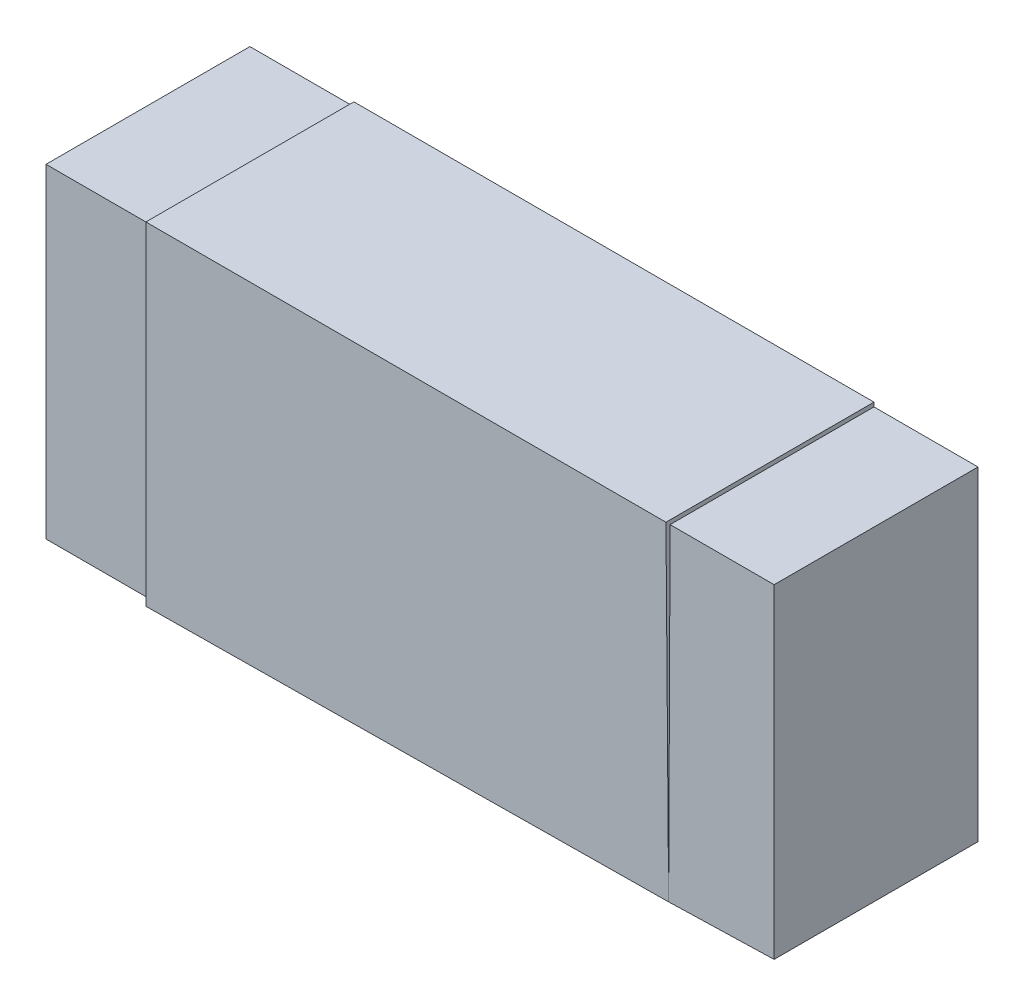
ISO-10303-21;
HEADER;
FILE_DESCRIPTION(('STEP AP214'),'2;1');
FILE_NAME('part.step','',(''),(''),'','','');
FILE_SCHEMA(('AUTOMOTIVE_DESIGN { 1 0 10303 214 1 1 1 1 }'));
ENDSEC;
DATA;
#1=APPLICATION_CONTEXT('core data for automotive mechanical design processes');
#2=APPLICATION_PROTOCOL_DEFINITION('international standard','automotive_design',2000,#1);
#3=PRODUCT_CONTEXT('',#1,'mechanical');
#4=PRODUCT('Part','Part','',(#3));
#5=PRODUCT_RELATED_PRODUCT_CATEGORY('part','',(#4));
#6=PRODUCT_DEFINITION_FORMATION('','',#4);
#7=PRODUCT_DEFINITION_CONTEXT('part definition',#1,'design');
#8=PRODUCT_DEFINITION('design','',#6,#7);
#9=PRODUCT_DEFINITION_SHAPE('','',#8);
#10=(LENGTH_UNIT() NAMED_UNIT(*) SI_UNIT(.MILLI.,.METRE.));
#11=(NAMED_UNIT(*) PLANE_ANGLE_UNIT() SI_UNIT($,.RADIAN.));
#12=(NAMED_UNIT(*) SI_UNIT($,.STERADIAN.) SOLID_ANGLE_UNIT());
#13=UNCERTAINTY_MEASURE_WITH_UNIT(LENGTH_MEASURE(1.E-05),#10,'distance_accuracy_value','');
#14=(GEOMETRIC_REPRESENTATION_CONTEXT(3) GLOBAL_UNCERTAINTY_ASSIGNED_CONTEXT((#13)) GLOBAL_UNIT_ASSIGNED_CONTEXT((#10,
#11,#12)) REPRESENTATION_CONTEXT('',''));
#15=CARTESIAN_POINT('',(0.,0.,0.));
#16=DIRECTION('',(0.,0.,1.));
#17=DIRECTION('',(1.,0.,0.));
#18=AXIS2_PLACEMENT_3D('',#15,#16,#17);
#19=CARTESIAN_POINT('',(-0.625,0.4,0.5));
#20=DIRECTION('',(1.,0.,0.));
#21=DIRECTION('',(0.,1.,0.));
#22=AXIS2_PLACEMENT_3D('',#19,#20,#21);
#23=PLANE('',#22);
#24=DIRECTION('',(0.,0.,-1.));
#25=VECTOR('',#24,1.);
#26=CARTESIAN_POINT('',(-0.625,0.39,0.49));
#27=LINE('',#26,#25);
#28=CARTESIAN_POINT('',(-0.625,0.39,0.49));
#29=VERTEX_POINT('',#28);
#30=CARTESIAN_POINT('',(-0.625,0.39,0.));
#31=VERTEX_POINT('',#30);
#32=EDGE_CURVE('E138',#29,#31,#27,.T.);
#33=ORIENTED_EDGE('',*,*,#32,.F.);
#34=DIRECTION('',(0.,-1.,0.));
#35=VECTOR('',#34,1.);
#36=CARTESIAN_POINT('',(-0.625,0.39,0.49));
#37=LINE('',#36,#35);
#38=CARTESIAN_POINT('',(-0.625,-0.39,0.49));
#39=VERTEX_POINT('',#38);
#40=EDGE_CURVE('E131',#29,#39,#37,.T.);
#41=ORIENTED_EDGE('',*,*,#40,.T.);
#42=DIRECTION('',(0.,0.,-1.));
#43=VECTOR('',#42,1.);
#44=CARTESIAN_POINT('',(-0.625,-0.39,0.49));
#45=LINE('',#44,#43);
#46=CARTESIAN_POINT('',(-0.625,-0.39,0.));
#47=VERTEX_POINT('',#46);
#48=EDGE_CURVE('E117',#39,#47,#45,.T.);
#49=ORIENTED_EDGE('',*,*,#48,.T.);
#50=DIRECTION('',(0.,-1.,0.));
#51=VECTOR('',#50,1.);
#52=CARTESIAN_POINT('',(-0.625,0.4,0.));
#53=LINE('',#52,#51);
#54=CARTESIAN_POINT('',(-0.625,-0.4,0.));
#55=VERTEX_POINT('',#54);
#56=EDGE_CURVE('E248',#47,#55,#53,.T.);
#57=ORIENTED_EDGE('',*,*,#56,.T.);
#58=DIRECTION('',(0.,0.,-1.));
#59=VECTOR('',#58,1.);
#60=CARTESIAN_POINT('',(-0.625,-0.4,0.5));
#61=LINE('',#60,#59);
#62=CARTESIAN_POINT('',(-0.625,-0.4,0.5));
#63=VERTEX_POINT('',#62);
#64=EDGE_CURVE('E256',#63,#55,#61,.T.);
#65=ORIENTED_EDGE('',*,*,#64,.F.);
#66=DIRECTION('',(0.,-1.,0.));
#67=VECTOR('',#66,1.);
#68=CARTESIAN_POINT('',(-0.625,0.4,0.5));
#69=LINE('',#68,#67);
#70=CARTESIAN_POINT('',(-0.625,0.4,0.5));
#71=VERTEX_POINT('',#70);
#72=EDGE_CURVE('E231',#71,#63,#69,.T.);
#73=ORIENTED_EDGE('',*,*,#72,.F.);
#74=DIRECTION('',(0.,0.,-1.));
#75=VECTOR('',#74,1.);
#76=CARTESIAN_POINT('',(-0.625,0.4,0.5));
#77=LINE('',#76,#75);
#78=CARTESIAN_POINT('',(-0.625,0.4,0.));
#79=VERTEX_POINT('',#78);
#80=EDGE_CURVE('E43',#71,#79,#77,.T.);
#81=ORIENTED_EDGE('',*,*,#80,.T.);
#82=EDGE_CURVE('E243',#79,#31,#53,.T.);
#83=ORIENTED_EDGE('',*,*,#82,.T.);
#84=EDGE_LOOP('',(#33,#41,#49,#57,#65,#73,#81,#83));
#85=FACE_BOUND('',#84,.T.);
#86=ADVANCED_FACE('F34',(#85),#23,.F.);
#87=CARTESIAN_POINT('',(0.625,0.4,0.5));
#88=DIRECTION('',(-1.,0.,0.));
#89=DIRECTION('',(0.,-1.,0.));
#90=AXIS2_PLACEMENT_3D('',#87,#88,#89);
#91=PLANE('',#90);
#92=DIRECTION('',(0.,1.,0.));
#93=VECTOR('',#92,1.);
#94=CARTESIAN_POINT('',(0.625,0.4,0.5));
#95=LINE('',#94,#93);
#96=CARTESIAN_POINT('',(0.625,-0.393535533905933,0.493535533905933));
#97=VERTEX_POINT('',#96);
#98=CARTESIAN_POINT('',(0.625,0.4,0.5));
#99=VERTEX_POINT('',#98);
#100=EDGE_CURVE('E234',#97,#99,#95,.T.);
#101=ORIENTED_EDGE('',*,*,#100,.F.);
#102=DIRECTION('',(0.,1.,0.));
#103=VECTOR('',#102,1.);
#104=CARTESIAN_POINT('',(0.625,0.39,0.49));
#105=LINE('',#104,#103);
#106=CARTESIAN_POINT('',(0.625,0.39,0.49));
#107=VERTEX_POINT('',#106);
#108=EDGE_CURVE('E158',#97,#107,#105,.T.);
#109=ORIENTED_EDGE('',*,*,#108,.T.);
#110=DIRECTION('',(0.,0.,-1.));
#111=VECTOR('',#110,1.);
#112=CARTESIAN_POINT('',(0.625,0.39,0.49));
#113=LINE('',#112,#111);
#114=CARTESIAN_POINT('',(0.625,0.39,0.));
#115=VERTEX_POINT('',#114);
#116=EDGE_CURVE('E171',#107,#115,#113,.T.);
#117=ORIENTED_EDGE('',*,*,#116,.T.);
#118=DIRECTION('',(0.,1.,0.));
#119=VECTOR('',#118,1.);
#120=CARTESIAN_POINT('',(0.625,0.4,0.));
#121=LINE('',#120,#119);
#122=CARTESIAN_POINT('',(0.625,0.4,0.));
#123=VERTEX_POINT('',#122);
#124=EDGE_CURVE('E38',#115,#123,#121,.T.);
#125=ORIENTED_EDGE('',*,*,#124,.T.);
#126=DIRECTION('',(0.,0.,-1.));
#127=VECTOR('',#126,1.);
#128=CARTESIAN_POINT('',(0.625,0.4,0.5));
#129=LINE('',#128,#127);
#130=EDGE_CURVE('E11',#99,#123,#129,.T.);
#131=ORIENTED_EDGE('',*,*,#130,.F.);
#132=EDGE_LOOP('',(#101,#109,#117,#125,#131));
#133=FACE_BOUND('',#132,.T.);
#134=ADVANCED_FACE('F36',(#133),#91,.F.);
#135=CARTESIAN_POINT('',(-0.625,0.4,0.5));
#136=DIRECTION('',(0.,-1.,0.));
#137=DIRECTION('',(0.,0.,-1.));
#138=AXIS2_PLACEMENT_3D('',#135,#136,#137);
#139=PLANE('',#138);
#140=DIRECTION('',(-1.,0.,0.));
#141=VECTOR('',#140,1.);
#142=CARTESIAN_POINT('',(-0.625,0.4,0.));
#143=LINE('',#142,#141);
#144=EDGE_CURVE('E252',#123,#79,#143,.T.);
#145=ORIENTED_EDGE('',*,*,#144,.T.);
#146=ORIENTED_EDGE('',*,*,#80,.F.);
#147=DIRECTION('',(-1.,0.,0.));
#148=VECTOR('',#147,1.);
#149=CARTESIAN_POINT('',(-0.625,0.4,0.5));
#150=LINE('',#149,#148);
#151=EDGE_CURVE('E237',#99,#71,#150,.T.);
#152=ORIENTED_EDGE('',*,*,#151,.F.);
#153=ORIENTED_EDGE('',*,*,#130,.T.);
#154=EDGE_LOOP('',(#145,#146,#152,#153));
#155=FACE_BOUND('',#154,.T.);
#156=ADVANCED_FACE('F216',(#155),#139,.F.);
#157=CARTESIAN_POINT('',(-0.625,-0.4,0.5));
#158=DIRECTION('',(0.,1.,0.));
#159=DIRECTION('',(0.,0.,1.));
#160=AXIS2_PLACEMENT_3D('',#157,#158,#159);
#161=PLANE('',#160);
#162=DIRECTION('',(1.,0.,0.));
#163=VECTOR('',#162,1.);
#164=CARTESIAN_POINT('',(-0.625,-0.4,0.));
#165=LINE('',#164,#163);
#166=CARTESIAN_POINT('',(0.625,-0.395,0.));
#167=VERTEX_POINT('',#166);
#168=EDGE_CURVE('E238',#55,#167,#165,.T.);
#169=ORIENTED_EDGE('',*,*,#168,.T.);
#170=CARTESIAN_POINT('',(0.625,-0.39,0.49));
#171=DIRECTION('',(0.,0.,-1.));
#172=VECTOR('',#171,1.);
#173=LINE('',#170,#172);
#174=EDGE_CURVE('E178',#97,#167,#173,.T.);
#175=ORIENTED_EDGE('',*,*,#174,.F.);
#176=DIRECTION('',(1.,0.,0.));
#177=VECTOR('',#176,1.);
#178=CARTESIAN_POINT('',(-0.625,-0.4,0.5));
#179=LINE('',#178,#177);
#180=EDGE_CURVE('E223',#63,#97,#179,.T.);
#181=ORIENTED_EDGE('',*,*,#180,.F.);
#182=ORIENTED_EDGE('',*,*,#64,.T.);
#183=EDGE_LOOP('',(#169,#175,#181,#182));
#184=FACE_BOUND('',#183,.T.);
#185=ADVANCED_FACE('F208',(#184),#161,.F.);
#186=CARTESIAN_POINT('',(0.,0.,0.5));
#187=DIRECTION('',(0.,0.,1.));
#188=DIRECTION('',(1.,0.,0.));
#189=AXIS2_PLACEMENT_3D('',#186,#187,#188);
#190=PLANE('',#189);
#191=ORIENTED_EDGE('',*,*,#100,.T.);
#192=ORIENTED_EDGE('',*,*,#151,.T.);
#193=ORIENTED_EDGE('',*,*,#72,.T.);
#194=ORIENTED_EDGE('',*,*,#180,.T.);
#195=EDGE_LOOP('',(#191,#192,#193,#194));
#196=FACE_BOUND('',#195,.T.);
#197=ADVANCED_FACE('F205',(#196),#190,.T.);
#198=CARTESIAN_POINT('',(0.,0.,0.));
#199=DIRECTION('',(0.,0.,1.));
#200=DIRECTION('',(1.,0.,0.));
#201=AXIS2_PLACEMENT_3D('',#198,#199,#200);
#202=PLANE('',#201);
#203=ORIENTED_EDGE('',*,*,#124,.F.);
#204=DIRECTION('',(1.,0.,0.));
#205=VECTOR('',#204,1.);
#206=CARTESIAN_POINT('',(0.625,0.39,0.));
#207=LINE('',#206,#205);
#208=CARTESIAN_POINT('',(0.875,0.39,0.));
#209=VERTEX_POINT('',#208);
#210=EDGE_CURVE('E59',#115,#209,#207,.T.);
#211=ORIENTED_EDGE('',*,*,#210,.T.);
#212=DIRECTION('',(0.,-1.,0.));
#213=VECTOR('',#212,1.);
#214=CARTESIAN_POINT('',(0.875,0.39,0.));
#215=LINE('',#214,#213);
#216=CARTESIAN_POINT('',(0.875,-0.39,0.));
#217=VERTEX_POINT('',#216);
#218=EDGE_CURVE('E163',#209,#217,#215,.T.);
#219=ORIENTED_EDGE('',*,*,#218,.T.);
#220=DIRECTION('',(-1.,0.,0.));
#221=VECTOR('',#220,1.);
#222=CARTESIAN_POINT('',(0.625,-0.39,0.));
#223=LINE('',#222,#221);
#224=EDGE_CURVE('E166',#217,#167,#223,.T.);
#225=ORIENTED_EDGE('',*,*,#224,.T.);
#226=ORIENTED_EDGE('',*,*,#168,.F.);
#227=ORIENTED_EDGE('',*,*,#56,.F.);
#228=DIRECTION('',(-1.,0.,0.));
#229=VECTOR('',#228,1.);
#230=CARTESIAN_POINT('',(-0.625,-0.39,0.));
#231=LINE('',#230,#229);
#232=CARTESIAN_POINT('',(-0.875,-0.39,0.));
#233=VERTEX_POINT('',#232);
#234=EDGE_CURVE('E51',#47,#233,#231,.T.);
#235=ORIENTED_EDGE('',*,*,#234,.T.);
#236=DIRECTION('',(0.,1.,0.));
#237=VECTOR('',#236,1.);
#238=CARTESIAN_POINT('',(-0.875,0.39,0.));
#239=LINE('',#238,#237);
#240=CARTESIAN_POINT('',(-0.875,0.39,0.));
#241=VERTEX_POINT('',#240);
#242=EDGE_CURVE('E142',#233,#241,#239,.T.);
#243=ORIENTED_EDGE('',*,*,#242,.T.);
#244=DIRECTION('',(1.,0.,0.));
#245=VECTOR('',#244,1.);
#246=CARTESIAN_POINT('',(-0.625,0.39,0.));
#247=LINE('',#246,#245);
#248=EDGE_CURVE('E139',#241,#31,#247,.T.);
#249=ORIENTED_EDGE('',*,*,#248,.T.);
#250=ORIENTED_EDGE('',*,*,#82,.F.);
#251=ORIENTED_EDGE('',*,*,#144,.F.);
#252=EDGE_LOOP('',(#203,#211,#219,#225,#226,#227,#235,#243,#249,#250,#251));
#253=FACE_BOUND('',#252,.T.);
#254=ADVANCED_FACE('F196',(#253),#202,.F.);
#255=CARTESIAN_POINT('',(0.625,-0.39,0.49));
#256=DIRECTION('',(0.,-1.,0.));
#257=DIRECTION('',(1.,0.,0.));
#258=AXIS2_PLACEMENT_3D('',#255,#256,#257);
#259=PLANE('',#258);
#260=ORIENTED_EDGE('',*,*,#224,.F.);
#261=DIRECTION('',(0.,0.,-1.));
#262=VECTOR('',#261,1.);
#263=CARTESIAN_POINT('',(0.875,-0.39,0.49));
#264=LINE('',#263,#262);
#265=CARTESIAN_POINT('',(0.875,-0.39,0.49));
#266=VERTEX_POINT('',#265);
#267=EDGE_CURVE('E167',#266,#217,#264,.T.);
#268=ORIENTED_EDGE('',*,*,#267,.F.);
#269=DIRECTION('',(-1.,0.,0.));
#270=VECTOR('',#269,1.);
#271=CARTESIAN_POINT('',(0.625,-0.39,0.49));
#272=LINE('',#271,#270);
#273=EDGE_CURVE('E161',#266,#97,#272,.T.);
#274=ORIENTED_EDGE('',*,*,#273,.T.);
#275=ORIENTED_EDGE('',*,*,#174,.T.);
#276=EDGE_LOOP('',(#260,#268,#274,#275));
#277=FACE_BOUND('',#276,.T.);
#278=ADVANCED_FACE('F185',(#277),#259,.T.);
#279=CARTESIAN_POINT('',(0.875,0.39,0.49));
#280=DIRECTION('',(1.,0.,0.));
#281=DIRECTION('',(0.,1.,0.));
#282=AXIS2_PLACEMENT_3D('',#279,#280,#281);
#283=PLANE('',#282);
#284=ORIENTED_EDGE('',*,*,#218,.F.);
#285=DIRECTION('',(0.,0.,-1.));
#286=VECTOR('',#285,1.);
#287=CARTESIAN_POINT('',(0.875,0.39,0.49));
#288=LINE('',#287,#286);
#289=CARTESIAN_POINT('',(0.875,0.39,0.49));
#290=VERTEX_POINT('',#289);
#291=EDGE_CURVE('E169',#290,#209,#288,.T.);
#292=ORIENTED_EDGE('',*,*,#291,.F.);
#293=DIRECTION('',(0.,-1.,0.));
#294=VECTOR('',#293,1.);
#295=CARTESIAN_POINT('',(0.875,0.39,0.49));
#296=LINE('',#295,#294);
#297=EDGE_CURVE('E157',#290,#266,#296,.T.);
#298=ORIENTED_EDGE('',*,*,#297,.T.);
#299=ORIENTED_EDGE('',*,*,#267,.T.);
#300=EDGE_LOOP('',(#284,#292,#298,#299));
#301=FACE_BOUND('',#300,.T.);
#302=ADVANCED_FACE('F195',(#301),#283,.T.);
#303=CARTESIAN_POINT('',(0.625,0.39,0.49));
#304=DIRECTION('',(0.,1.,0.));
#305=DIRECTION('',(-1.,0.,0.));
#306=AXIS2_PLACEMENT_3D('',#303,#304,#305);
#307=PLANE('',#306);
#308=ORIENTED_EDGE('',*,*,#210,.F.);
#309=ORIENTED_EDGE('',*,*,#116,.F.);
#310=DIRECTION('',(1.,0.,0.));
#311=VECTOR('',#310,1.);
#312=CARTESIAN_POINT('',(0.625,0.39,0.49));
#313=LINE('',#312,#311);
#314=EDGE_CURVE('E154',#107,#290,#313,.T.);
#315=ORIENTED_EDGE('',*,*,#314,.T.);
#316=ORIENTED_EDGE('',*,*,#291,.T.);
#317=EDGE_LOOP('',(#308,#309,#315,#316));
#318=FACE_BOUND('',#317,.T.);
#319=ADVANCED_FACE('F201',(#318),#307,.T.);
#320=CARTESIAN_POINT('',(0.,0.,0.49));
#321=DIRECTION('',(0.,0.,1.));
#322=DIRECTION('',(1.,0.,0.));
#323=AXIS2_PLACEMENT_3D('',#320,#321,#322);
#324=PLANE('',#323);
#325=ORIENTED_EDGE('',*,*,#108,.F.);
#326=ORIENTED_EDGE('',*,*,#273,.F.);
#327=ORIENTED_EDGE('',*,*,#297,.F.);
#328=ORIENTED_EDGE('',*,*,#314,.F.);
#329=EDGE_LOOP('',(#325,#326,#327,#328));
#330=FACE_BOUND('',#329,.T.);
#331=ADVANCED_FACE('F197',(#330),#324,.T.);
#332=CARTESIAN_POINT('',(-0.625,0.39,0.49));
#333=DIRECTION('',(0.,1.,0.));
#334=DIRECTION('',(0.,0.,1.));
#335=AXIS2_PLACEMENT_3D('',#332,#333,#334);
#336=PLANE('',#335);
#337=ORIENTED_EDGE('',*,*,#248,.F.);
#338=DIRECTION('',(0.,0.,-1.));
#339=VECTOR('',#338,1.);
#340=CARTESIAN_POINT('',(-0.875,0.39,0.49));
#341=LINE('',#340,#339);
#342=CARTESIAN_POINT('',(-0.875,0.39,0.49));
#343=VERTEX_POINT('',#342);
#344=EDGE_CURVE('E151',#343,#241,#341,.T.);
#345=ORIENTED_EDGE('',*,*,#344,.F.);
#346=DIRECTION('',(1.,0.,0.));
#347=VECTOR('',#346,1.);
#348=CARTESIAN_POINT('',(-0.625,0.39,0.49));
#349=LINE('',#348,#347);
#350=EDGE_CURVE('E125',#343,#29,#349,.T.);
#351=ORIENTED_EDGE('',*,*,#350,.T.);
#352=ORIENTED_EDGE('',*,*,#32,.T.);
#353=EDGE_LOOP('',(#337,#345,#351,#352));
#354=FACE_BOUND('',#353,.T.);
#355=ADVANCED_FACE('F267',(#354),#336,.T.);
#356=CARTESIAN_POINT('',(-0.875,0.39,0.49));
#357=DIRECTION('',(-1.,0.,0.));
#358=DIRECTION('',(0.,-1.,0.));
#359=AXIS2_PLACEMENT_3D('',#356,#357,#358);
#360=PLANE('',#359);
#361=ORIENTED_EDGE('',*,*,#242,.F.);
#362=DIRECTION('',(0.,0.,-1.));
#363=VECTOR('',#362,1.);
#364=CARTESIAN_POINT('',(-0.875,-0.39,0.49));
#365=LINE('',#364,#363);
#366=CARTESIAN_POINT('',(-0.875,-0.39,0.49));
#367=VERTEX_POINT('',#366);
#368=EDGE_CURVE('E124',#367,#233,#365,.T.);
#369=ORIENTED_EDGE('',*,*,#368,.F.);
#370=DIRECTION('',(0.,1.,0.));
#371=VECTOR('',#370,1.);
#372=CARTESIAN_POINT('',(-0.875,0.39,0.49));
#373=LINE('',#372,#371);
#374=EDGE_CURVE('E134',#367,#343,#373,.T.);
#375=ORIENTED_EDGE('',*,*,#374,.T.);
#376=ORIENTED_EDGE('',*,*,#344,.T.);
#377=EDGE_LOOP('',(#361,#369,#375,#376));
#378=FACE_BOUND('',#377,.T.);
#379=ADVANCED_FACE('F269',(#378),#360,.T.);
#380=CARTESIAN_POINT('',(-0.625,-0.39,0.49));
#381=DIRECTION('',(0.,-1.,0.));
#382=DIRECTION('',(0.,0.,-1.));
#383=AXIS2_PLACEMENT_3D('',#380,#381,#382);
#384=PLANE('',#383);
#385=ORIENTED_EDGE('',*,*,#234,.F.);
#386=ORIENTED_EDGE('',*,*,#48,.F.);
#387=DIRECTION('',(-1.,0.,0.));
#388=VECTOR('',#387,1.);
#389=CARTESIAN_POINT('',(-0.625,-0.39,0.49));
#390=LINE('',#389,#388);
#391=EDGE_CURVE('E120',#39,#367,#390,.T.);
#392=ORIENTED_EDGE('',*,*,#391,.T.);
#393=ORIENTED_EDGE('',*,*,#368,.T.);
#394=EDGE_LOOP('',(#385,#386,#392,#393));
#395=FACE_BOUND('',#394,.T.);
#396=ADVANCED_FACE('F119',(#395),#384,.T.);
#397=CARTESIAN_POINT('',(0.,0.,0.49));
#398=DIRECTION('',(0.,0.,-1.));
#399=DIRECTION('',(-1.,0.,0.));
#400=AXIS2_PLACEMENT_3D('',#397,#398,#399);
#401=PLANE('',#400);
#402=ORIENTED_EDGE('',*,*,#40,.F.);
#403=ORIENTED_EDGE('',*,*,#350,.F.);
#404=ORIENTED_EDGE('',*,*,#374,.F.);
#405=ORIENTED_EDGE('',*,*,#391,.F.);
#406=EDGE_LOOP('',(#402,#403,#404,#405));
#407=FACE_BOUND('',#406,.T.);
#408=ADVANCED_FACE('F129',(#407),#401,.F.);
#409=CLOSED_SHELL('',(#86,#134,#156,#185,#197,#254,#278,#302,#319,#331,#355,#379,#396,#408));
#410=MANIFOLD_SOLID_BREP('B2',#409);
#411=ADVANCED_BREP_SHAPE_REPRESENTATION('',(#18,#410),#14);
#412=SHAPE_DEFINITION_REPRESENTATION(#9,#411);
ENDSEC;
END-ISO-10303-21;
